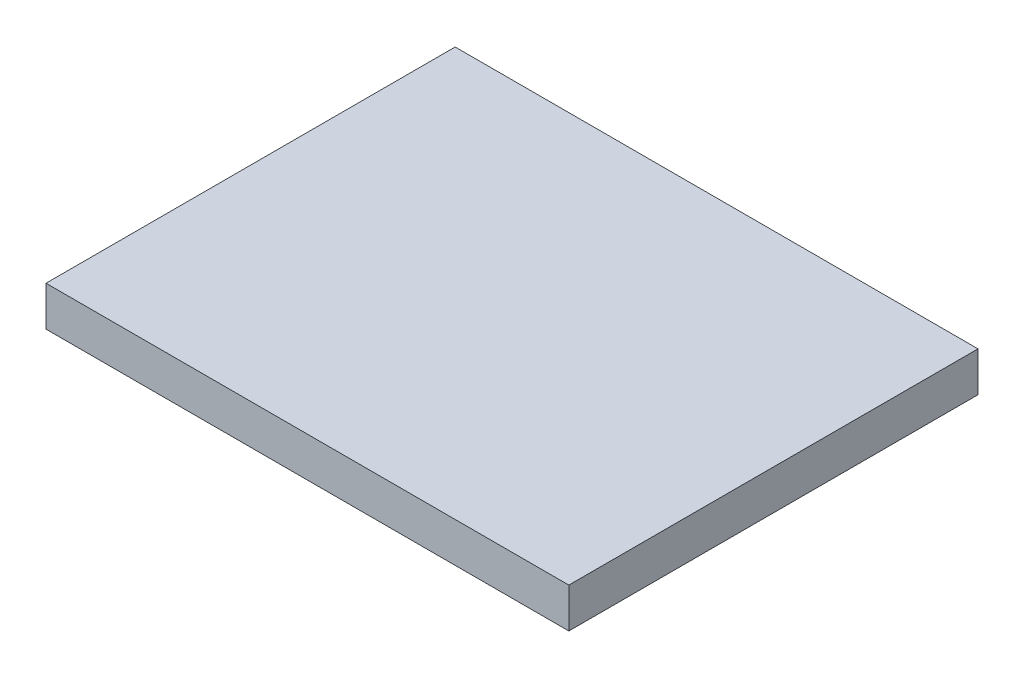
ISO-10303-21;
HEADER;
FILE_DESCRIPTION(('STEP AP214'),'2;1');
FILE_NAME('part.step','',(''),(''),'','','');
FILE_SCHEMA(('AUTOMOTIVE_DESIGN { 1 0 10303 214 1 1 1 1 }'));
ENDSEC;
DATA;
#1=APPLICATION_CONTEXT('core data for automotive mechanical design processes');
#2=APPLICATION_PROTOCOL_DEFINITION('international standard','automotive_design',2000,#1);
#3=PRODUCT_CONTEXT('',#1,'mechanical');
#4=PRODUCT('Part','Part','',(#3));
#5=PRODUCT_RELATED_PRODUCT_CATEGORY('part','',(#4));
#6=PRODUCT_DEFINITION_FORMATION('','',#4);
#7=PRODUCT_DEFINITION_CONTEXT('part definition',#1,'design');
#8=PRODUCT_DEFINITION('design','',#6,#7);
#9=PRODUCT_DEFINITION_SHAPE('','',#8);
#10=(LENGTH_UNIT() NAMED_UNIT(*) SI_UNIT(.MILLI.,.METRE.));
#11=(NAMED_UNIT(*) PLANE_ANGLE_UNIT() SI_UNIT($,.RADIAN.));
#12=(NAMED_UNIT(*) SI_UNIT($,.STERADIAN.) SOLID_ANGLE_UNIT());
#13=UNCERTAINTY_MEASURE_WITH_UNIT(LENGTH_MEASURE(1.E-05),#10,'distance_accuracy_value','');
#14=(GEOMETRIC_REPRESENTATION_CONTEXT(3) GLOBAL_UNCERTAINTY_ASSIGNED_CONTEXT((#13)) GLOBAL_UNIT_ASSIGNED_CONTEXT((#10,
#11,#12)) REPRESENTATION_CONTEXT('',''));
#15=CARTESIAN_POINT('',(0.,0.,0.));
#16=DIRECTION('',(0.,0.,1.));
#17=DIRECTION('',(1.,0.,0.));
#18=AXIS2_PLACEMENT_3D('',#15,#16,#17);
#19=CARTESIAN_POINT('',(-23.,3.5,-18.));
#20=DIRECTION('',(1.,0.,0.));
#21=DIRECTION('',(0.,0.,-1.));
#22=AXIS2_PLACEMENT_3D('',#19,#20,#21);
#23=PLANE('',#22);
#24=DIRECTION('',(0.,0.,1.));
#25=VECTOR('',#24,1.);
#26=CARTESIAN_POINT('',(-23.,0.,-18.));
#27=LINE('',#26,#25);
#28=CARTESIAN_POINT('',(-23.,0.,-18.));
#29=VERTEX_POINT('',#28);
#30=CARTESIAN_POINT('',(-23.,0.,18.));
#31=VERTEX_POINT('',#30);
#32=EDGE_CURVE('E96',#29,#31,#27,.T.);
#33=ORIENTED_EDGE('',*,*,#32,.T.);
#34=DIRECTION('',(0.,-1.,0.));
#35=VECTOR('',#34,1.);
#36=CARTESIAN_POINT('',(-23.,3.5,18.));
#37=LINE('',#36,#35);
#38=CARTESIAN_POINT('',(-23.,3.5,18.));
#39=VERTEX_POINT('',#38);
#40=EDGE_CURVE('E11',#39,#31,#37,.T.);
#41=ORIENTED_EDGE('',*,*,#40,.F.);
#42=DIRECTION('',(0.,0.,1.));
#43=VECTOR('',#42,1.);
#44=CARTESIAN_POINT('',(-23.,3.5,-18.));
#45=LINE('',#44,#43);
#46=CARTESIAN_POINT('',(-23.,3.5,-18.));
#47=VERTEX_POINT('',#46);
#48=EDGE_CURVE('E84',#47,#39,#45,.T.);
#49=ORIENTED_EDGE('',*,*,#48,.F.);
#50=DIRECTION('',(0.,-1.,0.));
#51=VECTOR('',#50,1.);
#52=CARTESIAN_POINT('',(-23.,3.5,-18.));
#53=LINE('',#52,#51);
#54=EDGE_CURVE('E92',#47,#29,#53,.T.);
#55=ORIENTED_EDGE('',*,*,#54,.T.);
#56=EDGE_LOOP('',(#33,#41,#49,#55));
#57=FACE_BOUND('',#56,.T.);
#58=ADVANCED_FACE('F33',(#57),#23,.F.);
#59=CARTESIAN_POINT('',(-23.,3.5,18.));
#60=DIRECTION('',(0.,0.,-1.));
#61=DIRECTION('',(-1.,0.,0.));
#62=AXIS2_PLACEMENT_3D('',#59,#60,#61);
#63=PLANE('',#62);
#64=DIRECTION('',(1.,0.,0.));
#65=VECTOR('',#64,1.);
#66=CARTESIAN_POINT('',(-23.,0.,18.));
#67=LINE('',#66,#65);
#68=CARTESIAN_POINT('',(23.,0.,18.));
#69=VERTEX_POINT('',#68);
#70=EDGE_CURVE('E88',#31,#69,#67,.T.);
#71=ORIENTED_EDGE('',*,*,#70,.T.);
#72=DIRECTION('',(0.,-1.,0.));
#73=VECTOR('',#72,1.);
#74=CARTESIAN_POINT('',(23.,3.5,18.));
#75=LINE('',#74,#73);
#76=CARTESIAN_POINT('',(23.,3.5,18.));
#77=VERTEX_POINT('',#76);
#78=EDGE_CURVE('E41',#77,#69,#75,.T.);
#79=ORIENTED_EDGE('',*,*,#78,.F.);
#80=DIRECTION('',(1.,0.,0.));
#81=VECTOR('',#80,1.);
#82=CARTESIAN_POINT('',(-23.,3.5,18.));
#83=LINE('',#82,#81);
#84=EDGE_CURVE('E79',#39,#77,#83,.T.);
#85=ORIENTED_EDGE('',*,*,#84,.F.);
#86=ORIENTED_EDGE('',*,*,#40,.T.);
#87=EDGE_LOOP('',(#71,#79,#85,#86));
#88=FACE_BOUND('',#87,.T.);
#89=ADVANCED_FACE('F87',(#88),#63,.F.);
#90=CARTESIAN_POINT('',(23.,3.5,-18.));
#91=DIRECTION('',(-1.,0.,0.));
#92=DIRECTION('',(0.,0.,1.));
#93=AXIS2_PLACEMENT_3D('',#90,#91,#92);
#94=PLANE('',#93);
#95=DIRECTION('',(0.,0.,-1.));
#96=VECTOR('',#95,1.);
#97=CARTESIAN_POINT('',(23.,0.,-18.));
#98=LINE('',#97,#96);
#99=CARTESIAN_POINT('',(23.,0.,-18.));
#100=VERTEX_POINT('',#99);
#101=EDGE_CURVE('E66',#69,#100,#98,.T.);
#102=ORIENTED_EDGE('',*,*,#101,.T.);
#103=DIRECTION('',(0.,-1.,0.));
#104=VECTOR('',#103,1.);
#105=CARTESIAN_POINT('',(23.,3.5,-18.));
#106=LINE('',#105,#104);
#107=CARTESIAN_POINT('',(23.,3.5,-18.));
#108=VERTEX_POINT('',#107);
#109=EDGE_CURVE('E89',#108,#100,#106,.T.);
#110=ORIENTED_EDGE('',*,*,#109,.F.);
#111=DIRECTION('',(0.,0.,-1.));
#112=VECTOR('',#111,1.);
#113=CARTESIAN_POINT('',(23.,3.5,-18.));
#114=LINE('',#113,#112);
#115=EDGE_CURVE('E82',#77,#108,#114,.T.);
#116=ORIENTED_EDGE('',*,*,#115,.F.);
#117=ORIENTED_EDGE('',*,*,#78,.T.);
#118=EDGE_LOOP('',(#102,#110,#116,#117));
#119=FACE_BOUND('',#118,.T.);
#120=ADVANCED_FACE('F90',(#119),#94,.F.);
#121=CARTESIAN_POINT('',(-23.,3.5,-18.));
#122=DIRECTION('',(0.,0.,1.));
#123=DIRECTION('',(1.,0.,0.));
#124=AXIS2_PLACEMENT_3D('',#121,#122,#123);
#125=PLANE('',#124);
#126=DIRECTION('',(-1.,0.,0.));
#127=VECTOR('',#126,1.);
#128=CARTESIAN_POINT('',(-23.,0.,-18.));
#129=LINE('',#128,#127);
#130=EDGE_CURVE('E72',#100,#29,#129,.T.);
#131=ORIENTED_EDGE('',*,*,#130,.T.);
#132=ORIENTED_EDGE('',*,*,#54,.F.);
#133=DIRECTION('',(-1.,0.,0.));
#134=VECTOR('',#133,1.);
#135=CARTESIAN_POINT('',(-23.,3.5,-18.));
#136=LINE('',#135,#134);
#137=EDGE_CURVE('E49',#108,#47,#136,.T.);
#138=ORIENTED_EDGE('',*,*,#137,.F.);
#139=ORIENTED_EDGE('',*,*,#109,.T.);
#140=EDGE_LOOP('',(#131,#132,#138,#139));
#141=FACE_BOUND('',#140,.T.);
#142=ADVANCED_FACE('F103',(#141),#125,.F.);
#143=CARTESIAN_POINT('',(0.,3.5,0.));
#144=DIRECTION('',(0.,1.,0.));
#145=DIRECTION('',(0.,0.,1.));
#146=AXIS2_PLACEMENT_3D('',#143,#144,#145);
#147=PLANE('',#146);
#148=ORIENTED_EDGE('',*,*,#48,.T.);
#149=ORIENTED_EDGE('',*,*,#84,.T.);
#150=ORIENTED_EDGE('',*,*,#115,.T.);
#151=ORIENTED_EDGE('',*,*,#137,.T.);
#152=EDGE_LOOP('',(#148,#149,#150,#151));
#153=FACE_BOUND('',#152,.T.);
#154=ADVANCED_FACE('F80',(#153),#147,.T.);
#155=CARTESIAN_POINT('',(0.,0.,0.));
#156=DIRECTION('',(0.,1.,0.));
#157=DIRECTION('',(0.,0.,1.));
#158=AXIS2_PLACEMENT_3D('',#155,#156,#157);
#159=PLANE('',#158);
#160=ORIENTED_EDGE('',*,*,#32,.F.);
#161=ORIENTED_EDGE('',*,*,#130,.F.);
#162=ORIENTED_EDGE('',*,*,#101,.F.);
#163=ORIENTED_EDGE('',*,*,#70,.F.);
#164=EDGE_LOOP('',(#160,#161,#162,#163));
#165=FACE_BOUND('',#164,.T.);
#166=ADVANCED_FACE('F106',(#165),#159,.F.);
#167=CLOSED_SHELL('',(#58,#89,#120,#142,#154,#166));
#168=MANIFOLD_SOLID_BREP('B2',#167);
#169=ADVANCED_BREP_SHAPE_REPRESENTATION('',(#18,#168),#14);
#170=SHAPE_DEFINITION_REPRESENTATION(#9,#169);
ENDSEC;
END-ISO-10303-21;
